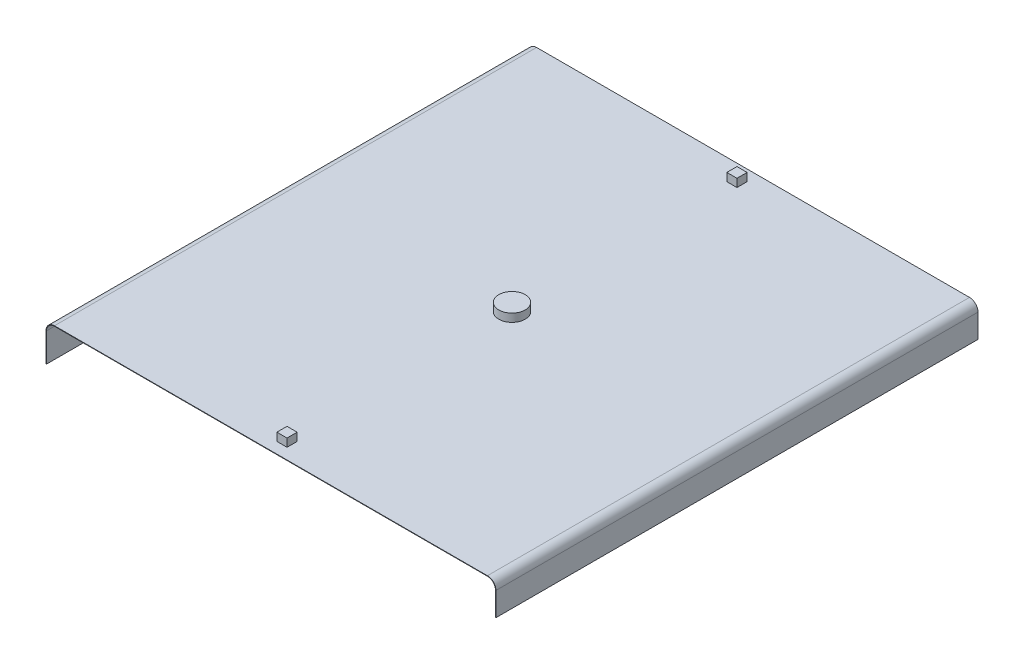
ISO-10303-21;
HEADER;
FILE_DESCRIPTION(('STEP AP214'),'2;1');
FILE_NAME('part.step','',(''),(''),'','','');
FILE_SCHEMA(('AUTOMOTIVE_DESIGN { 1 0 10303 214 1 1 1 1 }'));
ENDSEC;
DATA;
#1=APPLICATION_CONTEXT('core data for automotive mechanical design processes');
#2=APPLICATION_PROTOCOL_DEFINITION('international standard','automotive_design',2000,#1);
#3=PRODUCT_CONTEXT('',#1,'mechanical');
#4=PRODUCT('Part','Part','',(#3));
#5=PRODUCT_RELATED_PRODUCT_CATEGORY('part','',(#4));
#6=PRODUCT_DEFINITION_FORMATION('','',#4);
#7=PRODUCT_DEFINITION_CONTEXT('part definition',#1,'design');
#8=PRODUCT_DEFINITION('design','',#6,#7);
#9=PRODUCT_DEFINITION_SHAPE('','',#8);
#10=(LENGTH_UNIT() NAMED_UNIT(*) SI_UNIT(.MILLI.,.METRE.));
#11=(NAMED_UNIT(*) PLANE_ANGLE_UNIT() SI_UNIT($,.RADIAN.));
#12=(NAMED_UNIT(*) SI_UNIT($,.STERADIAN.) SOLID_ANGLE_UNIT());
#13=UNCERTAINTY_MEASURE_WITH_UNIT(LENGTH_MEASURE(1.E-05),#10,'distance_accuracy_value','');
#14=(GEOMETRIC_REPRESENTATION_CONTEXT(3) GLOBAL_UNCERTAINTY_ASSIGNED_CONTEXT((#13)) GLOBAL_UNIT_ASSIGNED_CONTEXT((#10,
#11,#12)) REPRESENTATION_CONTEXT('',''));
#15=CARTESIAN_POINT('',(0.,0.,0.));
#16=DIRECTION('',(0.,0.,1.));
#17=DIRECTION('',(1.,0.,0.));
#18=AXIS2_PLACEMENT_3D('',#15,#16,#17);
#19=CARTESIAN_POINT('',(-555.625,0.,762.));
#20=DIRECTION('',(0.,1.,0.));
#21=DIRECTION('',(0.,0.,1.));
#22=AXIS2_PLACEMENT_3D('',#19,#20,#21);
#23=PLANE('',#22);
#24=CARTESIAN_POINT('',(-200.025,0.,381.));
#25=DIRECTION('',(0.,1.,0.));
#26=DIRECTION('',(0.,0.,1.));
#27=AXIS2_PLACEMENT_3D('',#24,#25,#26);
#28=CIRCLE('',#27,20.955);
#29=CARTESIAN_POINT('',(-200.025,0.,401.955));
#30=VERTEX_POINT('',#29);
#31=EDGE_CURVE('E251',#30,#30,#28,.T.);
#32=ORIENTED_EDGE('',*,*,#31,.F.);
#33=EDGE_LOOP('',(#32));
#34=FACE_BOUND('',#33,.T.);
#35=DIRECTION('',(1.,0.,0.));
#36=VECTOR('',#35,1.);
#37=CARTESIAN_POINT('',(-555.625,0.,0.));
#38=LINE('',#37,#36);
#39=CARTESIAN_POINT('',(-542.1884,0.,0.));
#40=VERTEX_POINT('',#39);
#41=CARTESIAN_POINT('',(142.1384,0.,0.));
#42=VERTEX_POINT('',#41);
#43=EDGE_CURVE('E344',#40,#42,#38,.T.);
#44=ORIENTED_EDGE('',*,*,#43,.F.);
#45=DIRECTION('',(0.,0.,-1.));
#46=VECTOR('',#45,1.);
#47=CARTESIAN_POINT('',(-542.1884,0.,1.11022302462516E-13));
#48=LINE('',#47,#46);
#49=CARTESIAN_POINT('',(-542.1884,0.,762.));
#50=VERTEX_POINT('',#49);
#51=EDGE_CURVE('E290',#40,#50,#48,.F.);
#52=ORIENTED_EDGE('',*,*,#51,.T.);
#53=DIRECTION('',(1.,0.,0.));
#54=VECTOR('',#53,1.);
#55=CARTESIAN_POINT('',(-555.625,0.,762.));
#56=LINE('',#55,#54);
#57=CARTESIAN_POINT('',(142.1384,0.,762.));
#58=VERTEX_POINT('',#57);
#59=EDGE_CURVE('E325',#50,#58,#56,.T.);
#60=ORIENTED_EDGE('',*,*,#59,.T.);
#61=DIRECTION('',(0.,0.,-1.));
#62=VECTOR('',#61,1.);
#63=CARTESIAN_POINT('',(142.1384,0.,762.));
#64=LINE('',#63,#62);
#65=EDGE_CURVE('E355',#58,#42,#64,.T.);
#66=ORIENTED_EDGE('',*,*,#65,.T.);
#67=EDGE_LOOP('',(#44,#52,#60,#66));
#68=FACE_BOUND('',#67,.T.);
#69=DIRECTION('',(-1.,0.,0.));
#70=VECTOR('',#69,1.);
#71=CARTESIAN_POINT('',(-208.026,0.,728.599));
#72=LINE('',#71,#70);
#73=CARTESIAN_POINT('',(-192.024,0.,728.599));
#74=VERTEX_POINT('',#73);
#75=CARTESIAN_POINT('',(-208.026,0.,728.599));
#76=VERTEX_POINT('',#75);
#77=EDGE_CURVE('E223',#74,#76,#72,.T.);
#78=ORIENTED_EDGE('',*,*,#77,.F.);
#79=DIRECTION('',(0.,0.,-1.));
#80=VECTOR('',#79,1.);
#81=CARTESIAN_POINT('',(-192.024,0.,728.599));
#82=LINE('',#81,#80);
#83=CARTESIAN_POINT('',(-192.024,0.,744.601));
#84=VERTEX_POINT('',#83);
#85=EDGE_CURVE('E220',#84,#74,#82,.T.);
#86=ORIENTED_EDGE('',*,*,#85,.F.);
#87=DIRECTION('',(1.,0.,0.));
#88=VECTOR('',#87,1.);
#89=CARTESIAN_POINT('',(-208.026,0.,744.601));
#90=LINE('',#89,#88);
#91=CARTESIAN_POINT('',(-208.026,0.,744.601));
#92=VERTEX_POINT('',#91);
#93=EDGE_CURVE('E232',#92,#84,#90,.T.);
#94=ORIENTED_EDGE('',*,*,#93,.F.);
#95=DIRECTION('',(0.,0.,1.));
#96=VECTOR('',#95,1.);
#97=CARTESIAN_POINT('',(-208.026,0.,728.599));
#98=LINE('',#97,#96);
#99=EDGE_CURVE('E240',#76,#92,#98,.T.);
#100=ORIENTED_EDGE('',*,*,#99,.F.);
#101=EDGE_LOOP('',(#78,#86,#94,#100));
#102=FACE_BOUND('',#101,.T.);
#103=DIRECTION('',(-1.,0.,0.));
#104=VECTOR('',#103,1.);
#105=CARTESIAN_POINT('',(-208.026,0.,17.399));
#106=LINE('',#105,#104);
#107=CARTESIAN_POINT('',(-192.024,0.,17.399));
#108=VERTEX_POINT('',#107);
#109=CARTESIAN_POINT('',(-208.026,0.,17.399));
#110=VERTEX_POINT('',#109);
#111=EDGE_CURVE('E796',#108,#110,#106,.T.);
#112=ORIENTED_EDGE('',*,*,#111,.F.);
#113=DIRECTION('',(0.,0.,-1.));
#114=VECTOR('',#113,1.);
#115=CARTESIAN_POINT('',(-192.024,0.,17.399));
#116=LINE('',#115,#114);
#117=CARTESIAN_POINT('',(-192.024,0.,33.401));
#118=VERTEX_POINT('',#117);
#119=EDGE_CURVE('E218',#118,#108,#116,.T.);
#120=ORIENTED_EDGE('',*,*,#119,.F.);
#121=DIRECTION('',(1.,0.,0.));
#122=VECTOR('',#121,1.);
#123=CARTESIAN_POINT('',(-208.026,0.,33.401));
#124=LINE('',#123,#122);
#125=CARTESIAN_POINT('',(-208.026,0.,33.401));
#126=VERTEX_POINT('',#125);
#127=EDGE_CURVE('E214',#126,#118,#124,.T.);
#128=ORIENTED_EDGE('',*,*,#127,.F.);
#129=DIRECTION('',(0.,0.,1.));
#130=VECTOR('',#129,1.);
#131=CARTESIAN_POINT('',(-208.026,0.,17.399));
#132=LINE('',#131,#130);
#133=EDGE_CURVE('E798',#110,#126,#132,.T.);
#134=ORIENTED_EDGE('',*,*,#133,.F.);
#135=EDGE_LOOP('',(#112,#120,#128,#134));
#136=FACE_BOUND('',#135,.T.);
#137=ADVANCED_FACE('F58',(#34,#68,#102,#136),#23,.T.);
#138=CARTESIAN_POINT('',(154.8384,-13.4366,0.));
#139=DIRECTION('',(0.,0.,-1.));
#140=DIRECTION('',(-1.,0.,0.));
#141=AXIS2_PLACEMENT_3D('',#138,#139,#140);
#142=PLANE('',#141);
#143=DIRECTION('',(1.,0.,0.));
#144=VECTOR('',#143,1.);
#145=CARTESIAN_POINT('',(-555.625,-0.7366,0.));
#146=LINE('',#145,#144);
#147=CARTESIAN_POINT('',(-542.1884,-0.736599999999915,0.));
#148=VERTEX_POINT('',#147);
#149=CARTESIAN_POINT('',(142.1384,-0.7366,0.));
#150=VERTEX_POINT('',#149);
#151=EDGE_CURVE('E346',#148,#150,#146,.T.);
#152=ORIENTED_EDGE('',*,*,#151,.F.);
#153=DIRECTION('',(0.,1.,0.));
#154=VECTOR('',#153,1.);
#155=CARTESIAN_POINT('',(-542.1884,-0.736599999999915,0.));
#156=LINE('',#155,#154);
#157=EDGE_CURVE('E297',#148,#40,#156,.T.);
#158=ORIENTED_EDGE('',*,*,#157,.T.);
#159=ORIENTED_EDGE('',*,*,#43,.T.);
#160=DIRECTION('',(0.,-1.,0.));
#161=VECTOR('',#160,1.);
#162=CARTESIAN_POINT('',(142.1384,0.,0.));
#163=LINE('',#162,#161);
#164=EDGE_CURVE('E367',#42,#150,#163,.T.);
#165=ORIENTED_EDGE('',*,*,#164,.T.);
#166=EDGE_LOOP('',(#152,#158,#159,#165));
#167=FACE_BOUND('',#166,.T.);
#168=ADVANCED_FACE('F421',(#167),#142,.T.);
#169=CARTESIAN_POINT('',(-555.625,-0.7366,762.));
#170=DIRECTION('',(0.,1.,0.));
#171=DIRECTION('',(0.,0.,1.));
#172=AXIS2_PLACEMENT_3D('',#169,#170,#171);
#173=PLANE('',#172);
#174=DIRECTION('',(0.,0.,-1.));
#175=VECTOR('',#174,1.);
#176=CARTESIAN_POINT('',(-542.1884,-0.736599999999915,1.11022302462516E-13));
#177=LINE('',#176,#175);
#178=CARTESIAN_POINT('',(-542.1884,-0.736599999999915,762.));
#179=VERTEX_POINT('',#178);
#180=EDGE_CURVE('E303',#148,#179,#177,.F.);
#181=ORIENTED_EDGE('',*,*,#180,.F.);
#182=ORIENTED_EDGE('',*,*,#151,.T.);
#183=DIRECTION('',(0.,0.,-1.));
#184=VECTOR('',#183,1.);
#185=CARTESIAN_POINT('',(142.1384,-0.7366,762.));
#186=LINE('',#185,#184);
#187=CARTESIAN_POINT('',(142.1384,-0.7366,762.));
#188=VERTEX_POINT('',#187);
#189=EDGE_CURVE('E352',#188,#150,#186,.T.);
#190=ORIENTED_EDGE('',*,*,#189,.F.);
#191=DIRECTION('',(1.,0.,0.));
#192=VECTOR('',#191,1.);
#193=CARTESIAN_POINT('',(-555.625,-0.7366,762.));
#194=LINE('',#193,#192);
#195=EDGE_CURVE('E327',#179,#188,#194,.T.);
#196=ORIENTED_EDGE('',*,*,#195,.F.);
#197=EDGE_LOOP('',(#181,#182,#190,#196));
#198=FACE_BOUND('',#197,.T.);
#199=ADVANCED_FACE('F427',(#198),#173,.F.);
#200=CARTESIAN_POINT('',(155.575,-13.4366,762.));
#201=DIRECTION('',(0.,0.,1.));
#202=DIRECTION('',(1.,0.,0.));
#203=AXIS2_PLACEMENT_3D('',#200,#201,#202);
#204=PLANE('',#203);
#205=DIRECTION('',(-1.,0.,0.));
#206=VECTOR('',#205,1.);
#207=CARTESIAN_POINT('',(155.575,-13.4366,762.));
#208=LINE('',#207,#206);
#209=CARTESIAN_POINT('',(155.575,-13.4366,762.));
#210=VERTEX_POINT('',#209);
#211=CARTESIAN_POINT('',(154.8384,-13.4366,762.));
#212=VERTEX_POINT('',#211);
#213=EDGE_CURVE('E13',#210,#212,#208,.T.);
#214=ORIENTED_EDGE('',*,*,#213,.F.);
#215=CARTESIAN_POINT('',(142.1384,-13.4366,762.));
#216=DIRECTION('',(0.,0.,1.));
#217=DIRECTION('',(1.,0.,0.));
#218=AXIS2_PLACEMENT_3D('',#215,#216,#217);
#219=CIRCLE('',#218,13.4366);
#220=EDGE_CURVE('E322',#58,#210,#219,.F.);
#221=ORIENTED_EDGE('',*,*,#220,.F.);
#222=DIRECTION('',(0.,1.,0.));
#223=VECTOR('',#222,1.);
#224=CARTESIAN_POINT('',(142.1384,-0.7366,762.));
#225=LINE('',#224,#223);
#226=EDGE_CURVE('E66',#188,#58,#225,.T.);
#227=ORIENTED_EDGE('',*,*,#226,.F.);
#228=CARTESIAN_POINT('',(142.1384,-13.4366,762.));
#229=DIRECTION('',(0.,0.,1.));
#230=DIRECTION('',(1.,0.,0.));
#231=AXIS2_PLACEMENT_3D('',#228,#229,#230);
#232=CIRCLE('',#231,12.7);
#233=EDGE_CURVE('E329',#188,#212,#232,.F.);
#234=ORIENTED_EDGE('',*,*,#233,.T.);
#235=EDGE_LOOP('',(#214,#221,#227,#234));
#236=FACE_BOUND('',#235,.T.);
#237=ADVANCED_FACE('F60',(#236),#204,.T.);
#238=CARTESIAN_POINT('',(142.1384,-0.7366,762.));
#239=DIRECTION('',(0.,0.,1.));
#240=DIRECTION('',(1.,0.,0.));
#241=AXIS2_PLACEMENT_3D('',#238,#239,#240);
#242=PLANE('',#241);
#243=DIRECTION('',(0.,-1.,0.));
#244=VECTOR('',#243,1.);
#245=CARTESIAN_POINT('',(155.575,0.,762.));
#246=LINE('',#245,#244);
#247=CARTESIAN_POINT('',(155.575,-50.8,762.));
#248=VERTEX_POINT('',#247);
#249=EDGE_CURVE('E319',#210,#248,#246,.T.);
#250=ORIENTED_EDGE('',*,*,#249,.F.);
#251=ORIENTED_EDGE('',*,*,#213,.T.);
#252=DIRECTION('',(0.,1.,0.));
#253=VECTOR('',#252,1.);
#254=CARTESIAN_POINT('',(154.8384,0.,762.));
#255=LINE('',#254,#253);
#256=CARTESIAN_POINT('',(154.8384,-50.8,762.));
#257=VERTEX_POINT('',#256);
#258=EDGE_CURVE('E313',#212,#257,#255,.F.);
#259=ORIENTED_EDGE('',*,*,#258,.T.);
#260=DIRECTION('',(-1.,0.,0.));
#261=VECTOR('',#260,1.);
#262=CARTESIAN_POINT('',(155.575,-50.8,762.));
#263=LINE('',#262,#261);
#264=EDGE_CURVE('E315',#248,#257,#263,.T.);
#265=ORIENTED_EDGE('',*,*,#264,.F.);
#266=EDGE_LOOP('',(#250,#251,#259,#265));
#267=FACE_BOUND('',#266,.T.);
#268=ADVANCED_FACE('F394',(#267),#242,.T.);
#269=CARTESIAN_POINT('',(142.1384,0.,0.));
#270=DIRECTION('',(0.,0.,-1.));
#271=DIRECTION('',(-1.,0.,0.));
#272=AXIS2_PLACEMENT_3D('',#269,#270,#271);
#273=PLANE('',#272);
#274=ORIENTED_EDGE('',*,*,#164,.F.);
#275=CARTESIAN_POINT('',(142.1384,-13.4366,0.));
#276=DIRECTION('',(0.,0.,1.));
#277=DIRECTION('',(1.,0.,0.));
#278=AXIS2_PLACEMENT_3D('',#275,#276,#277);
#279=CIRCLE('',#278,13.4366);
#280=CARTESIAN_POINT('',(155.575,-13.4366,0.));
#281=VERTEX_POINT('',#280);
#282=EDGE_CURVE('E341',#42,#281,#279,.F.);
#283=ORIENTED_EDGE('',*,*,#282,.T.);
#284=DIRECTION('',(1.,0.,0.));
#285=VECTOR('',#284,1.);
#286=CARTESIAN_POINT('',(154.8384,-13.4366,0.));
#287=LINE('',#286,#285);
#288=CARTESIAN_POINT('',(154.8384,-13.4366,0.));
#289=VERTEX_POINT('',#288);
#290=EDGE_CURVE('E365',#289,#281,#287,.T.);
#291=ORIENTED_EDGE('',*,*,#290,.F.);
#292=CARTESIAN_POINT('',(142.1384,-13.4366,0.));
#293=DIRECTION('',(0.,0.,1.));
#294=DIRECTION('',(1.,0.,0.));
#295=AXIS2_PLACEMENT_3D('',#292,#293,#294);
#296=CIRCLE('',#295,12.7);
#297=EDGE_CURVE('E316',#150,#289,#296,.F.);
#298=ORIENTED_EDGE('',*,*,#297,.F.);
#299=EDGE_LOOP('',(#274,#283,#291,#298));
#300=FACE_BOUND('',#299,.T.);
#301=ADVANCED_FACE('F406',(#300),#273,.T.);
#302=CARTESIAN_POINT('',(154.8384,0.,762.));
#303=DIRECTION('',(1.,0.,0.));
#304=DIRECTION('',(0.,0.,-1.));
#305=AXIS2_PLACEMENT_3D('',#302,#303,#304);
#306=PLANE('',#305);
#307=DIRECTION('',(0.,1.,0.));
#308=VECTOR('',#307,1.);
#309=CARTESIAN_POINT('',(154.8384,0.,0.));
#310=LINE('',#309,#308);
#311=CARTESIAN_POINT('',(154.8384,-50.8,0.));
#312=VERTEX_POINT('',#311);
#313=EDGE_CURVE('E310',#289,#312,#310,.F.);
#314=ORIENTED_EDGE('',*,*,#313,.T.);
#315=DIRECTION('',(0.,0.,-1.));
#316=VECTOR('',#315,1.);
#317=CARTESIAN_POINT('',(154.8384,-50.8,762.));
#318=LINE('',#317,#316);
#319=EDGE_CURVE('E363',#257,#312,#318,.T.);
#320=ORIENTED_EDGE('',*,*,#319,.F.);
#321=ORIENTED_EDGE('',*,*,#258,.F.);
#322=DIRECTION('',(0.,0.,-1.));
#323=VECTOR('',#322,1.);
#324=CARTESIAN_POINT('',(154.8384,-13.4366,762.));
#325=LINE('',#324,#323);
#326=EDGE_CURVE('E332',#212,#289,#325,.T.);
#327=ORIENTED_EDGE('',*,*,#326,.T.);
#328=EDGE_LOOP('',(#314,#320,#321,#327));
#329=FACE_BOUND('',#328,.T.);
#330=ADVANCED_FACE('F410',(#329),#306,.F.);
#331=CARTESIAN_POINT('',(155.575,-50.8,762.));
#332=DIRECTION('',(0.,-1.,0.));
#333=DIRECTION('',(0.,0.,-1.));
#334=AXIS2_PLACEMENT_3D('',#331,#332,#333);
#335=PLANE('',#334);
#336=DIRECTION('',(-1.,0.,0.));
#337=VECTOR('',#336,1.);
#338=CARTESIAN_POINT('',(155.575,-50.8,0.));
#339=LINE('',#338,#337);
#340=CARTESIAN_POINT('',(155.575,-50.8,0.));
#341=VERTEX_POINT('',#340);
#342=EDGE_CURVE('E335',#341,#312,#339,.T.);
#343=ORIENTED_EDGE('',*,*,#342,.F.);
#344=DIRECTION('',(0.,0.,-1.));
#345=VECTOR('',#344,1.);
#346=CARTESIAN_POINT('',(155.575,-50.8,762.));
#347=LINE('',#346,#345);
#348=EDGE_CURVE('E361',#248,#341,#347,.T.);
#349=ORIENTED_EDGE('',*,*,#348,.F.);
#350=ORIENTED_EDGE('',*,*,#264,.T.);
#351=ORIENTED_EDGE('',*,*,#319,.T.);
#352=EDGE_LOOP('',(#343,#349,#350,#351));
#353=FACE_BOUND('',#352,.T.);
#354=ADVANCED_FACE('F399',(#353),#335,.T.);
#355=CARTESIAN_POINT('',(155.575,0.,762.));
#356=DIRECTION('',(1.,0.,0.));
#357=DIRECTION('',(0.,0.,-1.));
#358=AXIS2_PLACEMENT_3D('',#355,#356,#357);
#359=PLANE('',#358);
#360=DIRECTION('',(0.,-1.,0.));
#361=VECTOR('',#360,1.);
#362=CARTESIAN_POINT('',(155.575,0.,0.));
#363=LINE('',#362,#361);
#364=EDGE_CURVE('E338',#281,#341,#363,.T.);
#365=ORIENTED_EDGE('',*,*,#364,.F.);
#366=DIRECTION('',(0.,0.,-1.));
#367=VECTOR('',#366,1.);
#368=CARTESIAN_POINT('',(155.575,-13.4366,762.));
#369=LINE('',#368,#367);
#370=EDGE_CURVE('E358',#210,#281,#369,.T.);
#371=ORIENTED_EDGE('',*,*,#370,.F.);
#372=ORIENTED_EDGE('',*,*,#249,.T.);
#373=ORIENTED_EDGE('',*,*,#348,.T.);
#374=EDGE_LOOP('',(#365,#371,#372,#373));
#375=FACE_BOUND('',#374,.T.);
#376=ADVANCED_FACE('F392',(#375),#359,.T.);
#377=CARTESIAN_POINT('',(142.1384,-13.4366,762.));
#378=DIRECTION('',(0.,0.,-1.));
#379=DIRECTION('',(-1.,0.,0.));
#380=AXIS2_PLACEMENT_3D('',#377,#378,#379);
#381=CYLINDRICAL_SURFACE('',#380,13.4366);
#382=ORIENTED_EDGE('',*,*,#282,.F.);
#383=ORIENTED_EDGE('',*,*,#65,.F.);
#384=ORIENTED_EDGE('',*,*,#220,.T.);
#385=ORIENTED_EDGE('',*,*,#370,.T.);
#386=EDGE_LOOP('',(#382,#383,#384,#385));
#387=FACE_BOUND('',#386,.T.);
#388=ADVANCED_FACE('F382',(#387),#381,.T.);
#389=CARTESIAN_POINT('',(142.1384,-13.4366,762.));
#390=DIRECTION('',(0.,0.,-1.));
#391=DIRECTION('',(-1.,0.,0.));
#392=AXIS2_PLACEMENT_3D('',#389,#390,#391);
#393=CYLINDRICAL_SURFACE('',#392,12.7);
#394=ORIENTED_EDGE('',*,*,#297,.T.);
#395=ORIENTED_EDGE('',*,*,#326,.F.);
#396=ORIENTED_EDGE('',*,*,#233,.F.);
#397=ORIENTED_EDGE('',*,*,#189,.T.);
#398=EDGE_LOOP('',(#394,#395,#396,#397));
#399=FACE_BOUND('',#398,.T.);
#400=ADVANCED_FACE('F408',(#399),#393,.F.);
#401=CARTESIAN_POINT('',(142.1384,-13.4366,762.));
#402=DIRECTION('',(0.,0.,1.));
#403=DIRECTION('',(1.,0.,0.));
#404=AXIS2_PLACEMENT_3D('',#401,#402,#403);
#405=PLANE('',#404);
#406=DIRECTION('',(0.,1.,0.));
#407=VECTOR('',#406,1.);
#408=CARTESIAN_POINT('',(-542.1884,-0.736599999999915,762.));
#409=LINE('',#408,#407);
#410=EDGE_CURVE('E307',#179,#50,#409,.T.);
#411=ORIENTED_EDGE('',*,*,#410,.F.);
#412=ORIENTED_EDGE('',*,*,#195,.T.);
#413=ORIENTED_EDGE('',*,*,#226,.T.);
#414=ORIENTED_EDGE('',*,*,#59,.F.);
#415=EDGE_LOOP('',(#411,#412,#413,#414));
#416=FACE_BOUND('',#415,.T.);
#417=ADVANCED_FACE('F375',(#416),#405,.T.);
#418=CARTESIAN_POINT('',(142.1384,-13.4366,0.));
#419=DIRECTION('',(0.,0.,1.));
#420=DIRECTION('',(1.,0.,0.));
#421=AXIS2_PLACEMENT_3D('',#418,#419,#420);
#422=PLANE('',#421);
#423=ORIENTED_EDGE('',*,*,#313,.F.);
#424=ORIENTED_EDGE('',*,*,#290,.T.);
#425=ORIENTED_EDGE('',*,*,#364,.T.);
#426=ORIENTED_EDGE('',*,*,#342,.T.);
#427=EDGE_LOOP('',(#423,#424,#425,#426));
#428=FACE_BOUND('',#427,.T.);
#429=ADVANCED_FACE('F402',(#428),#422,.F.);
#430=CARTESIAN_POINT('',(-542.1884,-13.4366,762.));
#431=DIRECTION('',(0.,0.,1.));
#432=DIRECTION('',(1.,0.,0.));
#433=AXIS2_PLACEMENT_3D('',#430,#431,#432);
#434=PLANE('',#433);
#435=DIRECTION('',(-1.,0.,0.));
#436=VECTOR('',#435,1.);
#437=CARTESIAN_POINT('',(-555.625,-13.4365999999999,762.));
#438=LINE('',#437,#436);
#439=CARTESIAN_POINT('',(-554.8884,-13.4365999999999,762.));
#440=VERTEX_POINT('',#439);
#441=CARTESIAN_POINT('',(-555.625,-13.4365999999999,762.));
#442=VERTEX_POINT('',#441);
#443=EDGE_CURVE('E255',#440,#442,#438,.T.);
#444=ORIENTED_EDGE('',*,*,#443,.F.);
#445=CARTESIAN_POINT('',(-542.1884,-13.4366,762.));
#446=DIRECTION('',(0.,0.,-1.));
#447=DIRECTION('',(-1.,0.,0.));
#448=AXIS2_PLACEMENT_3D('',#445,#446,#447);
#449=CIRCLE('',#448,12.7);
#450=EDGE_CURVE('E300',#179,#440,#449,.F.);
#451=ORIENTED_EDGE('',*,*,#450,.F.);
#452=ORIENTED_EDGE('',*,*,#410,.T.);
#453=CARTESIAN_POINT('',(-542.1884,-13.4366,762.));
#454=DIRECTION('',(0.,0.,-1.));
#455=DIRECTION('',(-1.,0.,0.));
#456=AXIS2_PLACEMENT_3D('',#453,#454,#455);
#457=CIRCLE('',#456,13.4366);
#458=EDGE_CURVE('E293',#50,#442,#457,.F.);
#459=ORIENTED_EDGE('',*,*,#458,.T.);
#460=EDGE_LOOP('',(#444,#451,#452,#459));
#461=FACE_BOUND('',#460,.T.);
#462=ADVANCED_FACE('F465',(#461),#434,.T.);
#463=CARTESIAN_POINT('',(-542.1884,-13.4366,0.));
#464=DIRECTION('',(0.,0.,1.));
#465=DIRECTION('',(1.,0.,0.));
#466=AXIS2_PLACEMENT_3D('',#463,#464,#465);
#467=PLANE('',#466);
#468=CARTESIAN_POINT('',(-542.1884,-13.4366,0.));
#469=DIRECTION('',(0.,0.,-1.));
#470=DIRECTION('',(-1.,0.,0.));
#471=AXIS2_PLACEMENT_3D('',#468,#469,#470);
#472=CIRCLE('',#471,12.7);
#473=CARTESIAN_POINT('',(-554.8884,-13.4365999999999,0.));
#474=VERTEX_POINT('',#473);
#475=EDGE_CURVE('E260',#474,#148,#472,.T.);
#476=ORIENTED_EDGE('',*,*,#475,.F.);
#477=DIRECTION('',(-1.,0.,0.));
#478=VECTOR('',#477,1.);
#479=CARTESIAN_POINT('',(-554.8884,-13.4365999999999,0.));
#480=LINE('',#479,#478);
#481=CARTESIAN_POINT('',(-555.625,-13.4365999999999,0.));
#482=VERTEX_POINT('',#481);
#483=EDGE_CURVE('E283',#474,#482,#480,.T.);
#484=ORIENTED_EDGE('',*,*,#483,.T.);
#485=CARTESIAN_POINT('',(-542.1884,-13.4366,0.));
#486=DIRECTION('',(0.,0.,-1.));
#487=DIRECTION('',(-1.,0.,0.));
#488=AXIS2_PLACEMENT_3D('',#485,#486,#487);
#489=CIRCLE('',#488,13.4366);
#490=EDGE_CURVE('E294',#482,#40,#489,.T.);
#491=ORIENTED_EDGE('',*,*,#490,.T.);
#492=ORIENTED_EDGE('',*,*,#157,.F.);
#493=EDGE_LOOP('',(#476,#484,#491,#492));
#494=FACE_BOUND('',#493,.T.);
#495=ADVANCED_FACE('F472',(#494),#467,.F.);
#496=CARTESIAN_POINT('',(-542.1884,-13.4366,1.11022302462516E-13));
#497=DIRECTION('',(0.,0.,-1.));
#498=DIRECTION('',(-1.,0.,0.));
#499=AXIS2_PLACEMENT_3D('',#496,#497,#498);
#500=CYLINDRICAL_SURFACE('',#499,13.4366);
#501=ORIENTED_EDGE('',*,*,#51,.F.);
#502=ORIENTED_EDGE('',*,*,#490,.F.);
#503=DIRECTION('',(0.,0.,-1.));
#504=VECTOR('',#503,1.);
#505=CARTESIAN_POINT('',(-555.625,-13.4365999999999,0.));
#506=LINE('',#505,#504);
#507=EDGE_CURVE('E280',#442,#482,#506,.T.);
#508=ORIENTED_EDGE('',*,*,#507,.F.);
#509=ORIENTED_EDGE('',*,*,#458,.F.);
#510=EDGE_LOOP('',(#501,#502,#508,#509));
#511=FACE_BOUND('',#510,.T.);
#512=ADVANCED_FACE('F480',(#511),#500,.T.);
#513=CARTESIAN_POINT('',(-542.1884,-13.4366,1.11022302462516E-13));
#514=DIRECTION('',(0.,0.,-1.));
#515=DIRECTION('',(-1.,0.,0.));
#516=AXIS2_PLACEMENT_3D('',#513,#514,#515);
#517=CYLINDRICAL_SURFACE('',#516,12.7);
#518=ORIENTED_EDGE('',*,*,#180,.T.);
#519=ORIENTED_EDGE('',*,*,#450,.T.);
#520=DIRECTION('',(0.,0.,1.));
#521=VECTOR('',#520,1.);
#522=CARTESIAN_POINT('',(-554.8884,-13.4365999999999,762.));
#523=LINE('',#522,#521);
#524=EDGE_CURVE('E286',#440,#474,#523,.F.);
#525=ORIENTED_EDGE('',*,*,#524,.T.);
#526=ORIENTED_EDGE('',*,*,#475,.T.);
#527=EDGE_LOOP('',(#518,#519,#525,#526));
#528=FACE_BOUND('',#527,.T.);
#529=ADVANCED_FACE('F488',(#528),#517,.F.);
#530=CARTESIAN_POINT('',(-555.625,-0.736599999999997,0.));
#531=DIRECTION('',(0.,0.,-1.));
#532=DIRECTION('',(-1.,0.,0.));
#533=AXIS2_PLACEMENT_3D('',#530,#531,#532);
#534=PLANE('',#533);
#535=DIRECTION('',(0.,1.,0.));
#536=VECTOR('',#535,1.);
#537=CARTESIAN_POINT('',(-555.625,-0.736599999999997,0.));
#538=LINE('',#537,#536);
#539=CARTESIAN_POINT('',(-555.625,-58.928,0.));
#540=VERTEX_POINT('',#539);
#541=EDGE_CURVE('E264',#540,#482,#538,.T.);
#542=ORIENTED_EDGE('',*,*,#541,.T.);
#543=ORIENTED_EDGE('',*,*,#483,.F.);
#544=DIRECTION('',(0.,-1.,0.));
#545=VECTOR('',#544,1.);
#546=CARTESIAN_POINT('',(-554.8884,2.12013344946969E-12,0.));
#547=LINE('',#546,#545);
#548=CARTESIAN_POINT('',(-554.8884,-58.928,0.));
#549=VERTEX_POINT('',#548);
#550=EDGE_CURVE('E272',#549,#474,#547,.F.);
#551=ORIENTED_EDGE('',*,*,#550,.F.);
#552=DIRECTION('',(1.,0.,0.));
#553=VECTOR('',#552,1.);
#554=CARTESIAN_POINT('',(-555.625,-58.928,0.));
#555=LINE('',#554,#553);
#556=EDGE_CURVE('E258',#540,#549,#555,.T.);
#557=ORIENTED_EDGE('',*,*,#556,.F.);
#558=EDGE_LOOP('',(#542,#543,#551,#557));
#559=FACE_BOUND('',#558,.T.);
#560=ADVANCED_FACE('F495',(#559),#534,.T.);
#561=CARTESIAN_POINT('',(-555.625,-58.928,762.));
#562=DIRECTION('',(0.,0.,1.));
#563=DIRECTION('',(1.,0.,0.));
#564=AXIS2_PLACEMENT_3D('',#561,#562,#563);
#565=PLANE('',#564);
#566=DIRECTION('',(0.,1.,0.));
#567=VECTOR('',#566,1.);
#568=CARTESIAN_POINT('',(-554.8884,2.12013344946969E-12,762.));
#569=LINE('',#568,#567);
#570=CARTESIAN_POINT('',(-554.8884,-58.928,762.));
#571=VERTEX_POINT('',#570);
#572=EDGE_CURVE('E278',#440,#571,#569,.F.);
#573=ORIENTED_EDGE('',*,*,#572,.F.);
#574=ORIENTED_EDGE('',*,*,#443,.T.);
#575=DIRECTION('',(0.,-1.,0.));
#576=VECTOR('',#575,1.);
#577=CARTESIAN_POINT('',(-555.625,-58.928,762.));
#578=LINE('',#577,#576);
#579=CARTESIAN_POINT('',(-555.625,-58.928,762.));
#580=VERTEX_POINT('',#579);
#581=EDGE_CURVE('E270',#442,#580,#578,.T.);
#582=ORIENTED_EDGE('',*,*,#581,.T.);
#583=DIRECTION('',(1.,0.,0.));
#584=VECTOR('',#583,1.);
#585=CARTESIAN_POINT('',(-555.625,-58.928,762.));
#586=LINE('',#585,#584);
#587=EDGE_CURVE('E261',#580,#571,#586,.T.);
#588=ORIENTED_EDGE('',*,*,#587,.T.);
#589=EDGE_LOOP('',(#573,#574,#582,#588));
#590=FACE_BOUND('',#589,.T.);
#591=ADVANCED_FACE('F503',(#590),#565,.T.);
#592=CARTESIAN_POINT('',(-555.625,2.12270527462388E-12,0.));
#593=DIRECTION('',(-1.,0.,0.));
#594=DIRECTION('',(0.,-1.,0.));
#595=AXIS2_PLACEMENT_3D('',#592,#593,#594);
#596=PLANE('',#595);
#597=ORIENTED_EDGE('',*,*,#581,.F.);
#598=ORIENTED_EDGE('',*,*,#507,.T.);
#599=ORIENTED_EDGE('',*,*,#541,.F.);
#600=DIRECTION('',(0.,0.,-1.));
#601=VECTOR('',#600,1.);
#602=CARTESIAN_POINT('',(-555.625,-58.928,0.));
#603=LINE('',#602,#601);
#604=EDGE_CURVE('E267',#580,#540,#603,.T.);
#605=ORIENTED_EDGE('',*,*,#604,.F.);
#606=EDGE_LOOP('',(#597,#598,#599,#605));
#607=FACE_BOUND('',#606,.T.);
#608=ADVANCED_FACE('F511',(#607),#596,.T.);
#609=CARTESIAN_POINT('',(-554.8884,2.12013344946969E-12,0.));
#610=DIRECTION('',(-1.,0.,0.));
#611=DIRECTION('',(0.,-1.,0.));
#612=AXIS2_PLACEMENT_3D('',#609,#610,#611);
#613=PLANE('',#612);
#614=ORIENTED_EDGE('',*,*,#524,.F.);
#615=ORIENTED_EDGE('',*,*,#572,.T.);
#616=DIRECTION('',(0.,0.,1.));
#617=VECTOR('',#616,1.);
#618=CARTESIAN_POINT('',(-554.8884,-58.928,0.));
#619=LINE('',#618,#617);
#620=EDGE_CURVE('E275',#571,#549,#619,.F.);
#621=ORIENTED_EDGE('',*,*,#620,.T.);
#622=ORIENTED_EDGE('',*,*,#550,.T.);
#623=EDGE_LOOP('',(#614,#615,#621,#622));
#624=FACE_BOUND('',#623,.T.);
#625=ADVANCED_FACE('F519',(#624),#613,.F.);
#626=CARTESIAN_POINT('',(-555.625,-58.928,0.));
#627=DIRECTION('',(0.,-1.,0.));
#628=DIRECTION('',(1.,0.,0.));
#629=AXIS2_PLACEMENT_3D('',#626,#627,#628);
#630=PLANE('',#629);
#631=ORIENTED_EDGE('',*,*,#620,.F.);
#632=ORIENTED_EDGE('',*,*,#587,.F.);
#633=ORIENTED_EDGE('',*,*,#604,.T.);
#634=ORIENTED_EDGE('',*,*,#556,.T.);
#635=EDGE_LOOP('',(#631,#632,#633,#634));
#636=FACE_BOUND('',#635,.T.);
#637=ADVANCED_FACE('F526',(#636),#630,.T.);
#638=CARTESIAN_POINT('',(-200.025,12.7,381.));
#639=DIRECTION('',(0.,-1.,0.));
#640=DIRECTION('',(0.,0.,-1.));
#641=AXIS2_PLACEMENT_3D('',#638,#639,#640);
#642=CYLINDRICAL_SURFACE('',#641,20.955);
#643=CARTESIAN_POINT('',(-200.025,12.7,381.));
#644=DIRECTION('',(0.,1.,0.));
#645=DIRECTION('',(0.,0.,1.));
#646=AXIS2_PLACEMENT_3D('',#643,#644,#645);
#647=CIRCLE('',#646,20.955);
#648=CARTESIAN_POINT('',(-200.025,12.7,401.955));
#649=VERTEX_POINT('',#648);
#650=EDGE_CURVE('E252',#649,#649,#647,.T.);
#651=ORIENTED_EDGE('',*,*,#650,.F.);
#652=EDGE_LOOP('',(#651));
#653=FACE_BOUND('',#652,.T.);
#654=ORIENTED_EDGE('',*,*,#31,.T.);
#655=EDGE_LOOP('',(#654));
#656=FACE_BOUND('',#655,.T.);
#657=ADVANCED_FACE('F534',(#653,#656),#642,.T.);
#658=CARTESIAN_POINT('',(-200.025,12.7,381.));
#659=DIRECTION('',(0.,1.,0.));
#660=DIRECTION('',(0.,0.,1.));
#661=AXIS2_PLACEMENT_3D('',#658,#659,#660);
#662=PLANE('',#661);
#663=ORIENTED_EDGE('',*,*,#650,.T.);
#664=EDGE_LOOP('',(#663));
#665=FACE_BOUND('',#664,.T.);
#666=ADVANCED_FACE('F543',(#665),#662,.T.);
#667=CARTESIAN_POINT('',(-192.024,12.7,728.599));
#668=DIRECTION('',(-1.,0.,0.));
#669=DIRECTION('',(0.,0.,1.));
#670=AXIS2_PLACEMENT_3D('',#667,#668,#669);
#671=PLANE('',#670);
#672=ORIENTED_EDGE('',*,*,#85,.T.);
#673=DIRECTION('',(0.,-1.,0.));
#674=VECTOR('',#673,1.);
#675=CARTESIAN_POINT('',(-192.024,12.7,728.599));
#676=LINE('',#675,#674);
#677=CARTESIAN_POINT('',(-192.024,12.7,728.599));
#678=VERTEX_POINT('',#677);
#679=EDGE_CURVE('E249',#678,#74,#676,.T.);
#680=ORIENTED_EDGE('',*,*,#679,.F.);
#681=DIRECTION('',(0.,0.,-1.));
#682=VECTOR('',#681,1.);
#683=CARTESIAN_POINT('',(-192.024,12.7,728.599));
#684=LINE('',#683,#682);
#685=CARTESIAN_POINT('',(-192.024,12.7,744.601));
#686=VERTEX_POINT('',#685);
#687=EDGE_CURVE('E228',#686,#678,#684,.T.);
#688=ORIENTED_EDGE('',*,*,#687,.F.);
#689=DIRECTION('',(0.,-1.,0.));
#690=VECTOR('',#689,1.);
#691=CARTESIAN_POINT('',(-192.024,12.7,744.601));
#692=LINE('',#691,#690);
#693=EDGE_CURVE('E237',#686,#84,#692,.T.);
#694=ORIENTED_EDGE('',*,*,#693,.T.);
#695=EDGE_LOOP('',(#672,#680,#688,#694));
#696=FACE_BOUND('',#695,.T.);
#697=ADVANCED_FACE('F551',(#696),#671,.F.);
#698=CARTESIAN_POINT('',(-208.026,12.7,728.599));
#699=DIRECTION('',(0.,0.,1.));
#700=DIRECTION('',(1.,0.,0.));
#701=AXIS2_PLACEMENT_3D('',#698,#699,#700);
#702=PLANE('',#701);
#703=ORIENTED_EDGE('',*,*,#77,.T.);
#704=DIRECTION('',(0.,-1.,0.));
#705=VECTOR('',#704,1.);
#706=CARTESIAN_POINT('',(-208.026,12.7,728.599));
#707=LINE('',#706,#705);
#708=CARTESIAN_POINT('',(-208.026,12.7,728.599));
#709=VERTEX_POINT('',#708);
#710=EDGE_CURVE('E246',#709,#76,#707,.T.);
#711=ORIENTED_EDGE('',*,*,#710,.F.);
#712=DIRECTION('',(-1.,0.,0.));
#713=VECTOR('',#712,1.);
#714=CARTESIAN_POINT('',(-208.026,12.7,728.599));
#715=LINE('',#714,#713);
#716=EDGE_CURVE('E231',#678,#709,#715,.T.);
#717=ORIENTED_EDGE('',*,*,#716,.F.);
#718=ORIENTED_EDGE('',*,*,#679,.T.);
#719=EDGE_LOOP('',(#703,#711,#717,#718));
#720=FACE_BOUND('',#719,.T.);
#721=ADVANCED_FACE('F559',(#720),#702,.F.);
#722=CARTESIAN_POINT('',(-208.026,12.7,728.599));
#723=DIRECTION('',(1.,0.,0.));
#724=DIRECTION('',(0.,0.,-1.));
#725=AXIS2_PLACEMENT_3D('',#722,#723,#724);
#726=PLANE('',#725);
#727=ORIENTED_EDGE('',*,*,#99,.T.);
#728=DIRECTION('',(0.,-1.,0.));
#729=VECTOR('',#728,1.);
#730=CARTESIAN_POINT('',(-208.026,12.7,744.601));
#731=LINE('',#730,#729);
#732=CARTESIAN_POINT('',(-208.026,12.7,744.601));
#733=VERTEX_POINT('',#732);
#734=EDGE_CURVE('E81',#733,#92,#731,.T.);
#735=ORIENTED_EDGE('',*,*,#734,.F.);
#736=DIRECTION('',(0.,0.,1.));
#737=VECTOR('',#736,1.);
#738=CARTESIAN_POINT('',(-208.026,12.7,728.599));
#739=LINE('',#738,#737);
#740=EDGE_CURVE('E234',#709,#733,#739,.T.);
#741=ORIENTED_EDGE('',*,*,#740,.F.);
#742=ORIENTED_EDGE('',*,*,#710,.T.);
#743=EDGE_LOOP('',(#727,#735,#741,#742));
#744=FACE_BOUND('',#743,.T.);
#745=ADVANCED_FACE('F567',(#744),#726,.F.);
#746=CARTESIAN_POINT('',(-208.026,12.7,744.601));
#747=DIRECTION('',(0.,0.,-1.));
#748=DIRECTION('',(-1.,0.,0.));
#749=AXIS2_PLACEMENT_3D('',#746,#747,#748);
#750=PLANE('',#749);
#751=ORIENTED_EDGE('',*,*,#93,.T.);
#752=ORIENTED_EDGE('',*,*,#693,.F.);
#753=DIRECTION('',(1.,0.,0.));
#754=VECTOR('',#753,1.);
#755=CARTESIAN_POINT('',(-208.026,12.7,744.601));
#756=LINE('',#755,#754);
#757=EDGE_CURVE('E236',#733,#686,#756,.T.);
#758=ORIENTED_EDGE('',*,*,#757,.F.);
#759=ORIENTED_EDGE('',*,*,#734,.T.);
#760=EDGE_LOOP('',(#751,#752,#758,#759));
#761=FACE_BOUND('',#760,.T.);
#762=ADVANCED_FACE('F575',(#761),#750,.F.);
#763=CARTESIAN_POINT('',(0.,12.7,0.));
#764=DIRECTION('',(0.,1.,0.));
#765=DIRECTION('',(0.,0.,1.));
#766=AXIS2_PLACEMENT_3D('',#763,#764,#765);
#767=PLANE('',#766);
#768=ORIENTED_EDGE('',*,*,#687,.T.);
#769=ORIENTED_EDGE('',*,*,#716,.T.);
#770=ORIENTED_EDGE('',*,*,#740,.T.);
#771=ORIENTED_EDGE('',*,*,#757,.T.);
#772=EDGE_LOOP('',(#768,#769,#770,#771));
#773=FACE_BOUND('',#772,.T.);
#774=ADVANCED_FACE('F583',(#773),#767,.T.);
#775=CARTESIAN_POINT('',(-192.024,12.7,17.399));
#776=DIRECTION('',(-1.,0.,0.));
#777=DIRECTION('',(0.,0.,1.));
#778=AXIS2_PLACEMENT_3D('',#775,#776,#777);
#779=PLANE('',#778);
#780=ORIENTED_EDGE('',*,*,#119,.T.);
#781=DIRECTION('',(0.,-1.,0.));
#782=VECTOR('',#781,1.);
#783=CARTESIAN_POINT('',(-192.024,12.7,17.399));
#784=LINE('',#783,#782);
#785=CARTESIAN_POINT('',(-192.024,12.7,17.399));
#786=VERTEX_POINT('',#785);
#787=EDGE_CURVE('E199',#786,#108,#784,.T.);
#788=ORIENTED_EDGE('',*,*,#787,.F.);
#789=DIRECTION('',(0.,0.,-1.));
#790=VECTOR('',#789,1.);
#791=CARTESIAN_POINT('',(-192.024,12.7,17.399));
#792=LINE('',#791,#790);
#793=CARTESIAN_POINT('',(-192.024,12.7,33.401));
#794=VERTEX_POINT('',#793);
#795=EDGE_CURVE('E206',#794,#786,#792,.T.);
#796=ORIENTED_EDGE('',*,*,#795,.F.);
#797=DIRECTION('',(0.,-1.,0.));
#798=VECTOR('',#797,1.);
#799=CARTESIAN_POINT('',(-192.024,12.7,33.401));
#800=LINE('',#799,#798);
#801=EDGE_CURVE('E805',#794,#118,#800,.T.);
#802=ORIENTED_EDGE('',*,*,#801,.T.);
#803=EDGE_LOOP('',(#780,#788,#796,#802));
#804=FACE_BOUND('',#803,.T.);
#805=ADVANCED_FACE('F216',(#804),#779,.F.);
#806=CARTESIAN_POINT('',(-208.026,12.7,17.399));
#807=DIRECTION('',(0.,0.,1.));
#808=DIRECTION('',(1.,0.,0.));
#809=AXIS2_PLACEMENT_3D('',#806,#807,#808);
#810=PLANE('',#809);
#811=ORIENTED_EDGE('',*,*,#111,.T.);
#812=DIRECTION('',(0.,-1.,0.));
#813=VECTOR('',#812,1.);
#814=CARTESIAN_POINT('',(-208.026,12.7,17.399));
#815=LINE('',#814,#813);
#816=CARTESIAN_POINT('',(-208.026,12.7,17.399));
#817=VERTEX_POINT('',#816);
#818=EDGE_CURVE('E202',#817,#110,#815,.T.);
#819=ORIENTED_EDGE('',*,*,#818,.F.);
#820=DIRECTION('',(-1.,0.,0.));
#821=VECTOR('',#820,1.);
#822=CARTESIAN_POINT('',(-208.026,12.7,17.399));
#823=LINE('',#822,#821);
#824=EDGE_CURVE('E195',#786,#817,#823,.T.);
#825=ORIENTED_EDGE('',*,*,#824,.F.);
#826=ORIENTED_EDGE('',*,*,#787,.T.);
#827=EDGE_LOOP('',(#811,#819,#825,#826));
#828=FACE_BOUND('',#827,.T.);
#829=ADVANCED_FACE('F197',(#828),#810,.F.);
#830=CARTESIAN_POINT('',(-208.026,12.7,17.399));
#831=DIRECTION('',(1.,0.,0.));
#832=DIRECTION('',(0.,0.,-1.));
#833=AXIS2_PLACEMENT_3D('',#830,#831,#832);
#834=PLANE('',#833);
#835=ORIENTED_EDGE('',*,*,#133,.T.);
#836=DIRECTION('',(0.,-1.,0.));
#837=VECTOR('',#836,1.);
#838=CARTESIAN_POINT('',(-208.026,12.7,33.401));
#839=LINE('',#838,#837);
#840=CARTESIAN_POINT('',(-208.026,12.7,33.401));
#841=VERTEX_POINT('',#840);
#842=EDGE_CURVE('E73',#841,#126,#839,.T.);
#843=ORIENTED_EDGE('',*,*,#842,.F.);
#844=DIRECTION('',(0.,0.,1.));
#845=VECTOR('',#844,1.);
#846=CARTESIAN_POINT('',(-208.026,12.7,17.399));
#847=LINE('',#846,#845);
#848=EDGE_CURVE('E205',#817,#841,#847,.T.);
#849=ORIENTED_EDGE('',*,*,#848,.F.);
#850=ORIENTED_EDGE('',*,*,#818,.T.);
#851=EDGE_LOOP('',(#835,#843,#849,#850));
#852=FACE_BOUND('',#851,.T.);
#853=ADVANCED_FACE('F604',(#852),#834,.F.);
#854=CARTESIAN_POINT('',(-208.026,12.7,33.401));
#855=DIRECTION('',(0.,0.,-1.));
#856=DIRECTION('',(-1.,0.,0.));
#857=AXIS2_PLACEMENT_3D('',#854,#855,#856);
#858=PLANE('',#857);
#859=ORIENTED_EDGE('',*,*,#127,.T.);
#860=ORIENTED_EDGE('',*,*,#801,.F.);
#861=DIRECTION('',(1.,0.,0.));
#862=VECTOR('',#861,1.);
#863=CARTESIAN_POINT('',(-208.026,12.7,33.401));
#864=LINE('',#863,#862);
#865=EDGE_CURVE('E210',#841,#794,#864,.T.);
#866=ORIENTED_EDGE('',*,*,#865,.F.);
#867=ORIENTED_EDGE('',*,*,#842,.T.);
#868=EDGE_LOOP('',(#859,#860,#866,#867));
#869=FACE_BOUND('',#868,.T.);
#870=ADVANCED_FACE('F611',(#869),#858,.F.);
#871=CARTESIAN_POINT('',(0.,12.7,0.));
#872=DIRECTION('',(0.,1.,0.));
#873=DIRECTION('',(0.,0.,1.));
#874=AXIS2_PLACEMENT_3D('',#871,#872,#873);
#875=PLANE('',#874);
#876=ORIENTED_EDGE('',*,*,#795,.T.);
#877=ORIENTED_EDGE('',*,*,#824,.T.);
#878=ORIENTED_EDGE('',*,*,#848,.T.);
#879=ORIENTED_EDGE('',*,*,#865,.T.);
#880=EDGE_LOOP('',(#876,#877,#878,#879));
#881=FACE_BOUND('',#880,.T.);
#882=ADVANCED_FACE('F209',(#881),#875,.T.);
#883=CLOSED_SHELL('',(#137,#168,#199,#237,#268,#301,#330,#354,#376,#388,#400,#417,#429,#462,
#495,#512,#529,#560,#591,#608,#625,#637,#657,#666,#697,#721,#745,#762,#774,#805,#829,#853,#870,#882));
#884=MANIFOLD_SOLID_BREP('B2',#883);
#885=ADVANCED_BREP_SHAPE_REPRESENTATION('',(#18,#884),#14);
#886=SHAPE_DEFINITION_REPRESENTATION(#9,#885);
ENDSEC;
END-ISO-10303-21;
